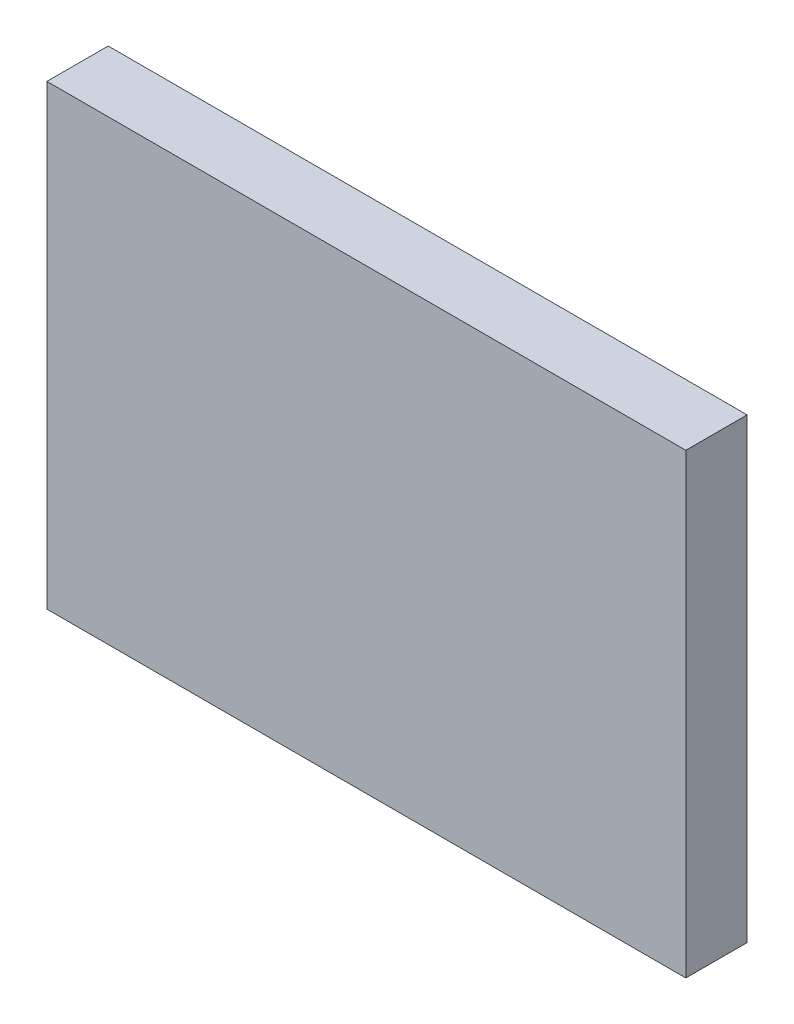
ISO-10303-21;
HEADER;
FILE_DESCRIPTION(('STEP AP214'),'2;1');
FILE_NAME('part.step','',(''),(''),'','','');
FILE_SCHEMA(('AUTOMOTIVE_DESIGN { 1 0 10303 214 1 1 1 1 }'));
ENDSEC;
DATA;
#1=APPLICATION_CONTEXT('core data for automotive mechanical design processes');
#2=APPLICATION_PROTOCOL_DEFINITION('international standard','automotive_design',2000,#1);
#3=PRODUCT_CONTEXT('',#1,'mechanical');
#4=PRODUCT('Part','Part','',(#3));
#5=PRODUCT_RELATED_PRODUCT_CATEGORY('part','',(#4));
#6=PRODUCT_DEFINITION_FORMATION('','',#4);
#7=PRODUCT_DEFINITION_CONTEXT('part definition',#1,'design');
#8=PRODUCT_DEFINITION('design','',#6,#7);
#9=PRODUCT_DEFINITION_SHAPE('','',#8);
#10=(LENGTH_UNIT() NAMED_UNIT(*) SI_UNIT(.MILLI.,.METRE.));
#11=(NAMED_UNIT(*) PLANE_ANGLE_UNIT() SI_UNIT($,.RADIAN.));
#12=(NAMED_UNIT(*) SI_UNIT($,.STERADIAN.) SOLID_ANGLE_UNIT());
#13=UNCERTAINTY_MEASURE_WITH_UNIT(LENGTH_MEASURE(1.E-05),#10,'distance_accuracy_value','');
#14=(GEOMETRIC_REPRESENTATION_CONTEXT(3) GLOBAL_UNCERTAINTY_ASSIGNED_CONTEXT((#13)) GLOBAL_UNIT_ASSIGNED_CONTEXT((#10,
#11,#12)) REPRESENTATION_CONTEXT('',''));
#15=CARTESIAN_POINT('',(0.,0.,0.));
#16=DIRECTION('',(0.,0.,1.));
#17=DIRECTION('',(1.,0.,0.));
#18=AXIS2_PLACEMENT_3D('',#15,#16,#17);
#19=CARTESIAN_POINT('',(1.2400408919979,-0.626373786984169,0.));
#20=DIRECTION('',(1.,0.,0.));
#21=DIRECTION('',(0.,1.,0.));
#22=AXIS2_PLACEMENT_3D('',#19,#20,#21);
#23=PLANE('',#22);
#24=DIRECTION('',(0.,1.,0.));
#25=VECTOR('',#24,1.);
#26=CARTESIAN_POINT('',(1.2400408919979,-0.626373786984169,0.));
#27=LINE('',#26,#25);
#28=CARTESIAN_POINT('',(1.2400408919979,-0.626373786984169,0.));
#29=VERTEX_POINT('',#28);
#30=CARTESIAN_POINT('',(1.2400408919979,-0.604008281971269,0.));
#31=VERTEX_POINT('',#30);
#32=EDGE_CURVE('E11',#29,#31,#27,.T.);
#33=ORIENTED_EDGE('',*,*,#32,.T.);
#34=DIRECTION('',(0.,0.,1.));
#35=VECTOR('',#34,1.);
#36=CARTESIAN_POINT('',(1.2400408919979,-0.604008281971269,0.));
#37=LINE('',#36,#35);
#38=CARTESIAN_POINT('',(1.2400408919979,-0.604008281971269,0.003));
#39=VERTEX_POINT('',#38);
#40=EDGE_CURVE('E24',#31,#39,#37,.T.);
#41=ORIENTED_EDGE('',*,*,#40,.T.);
#42=DIRECTION('',(0.,1.,0.));
#43=VECTOR('',#42,1.);
#44=CARTESIAN_POINT('',(1.2400408919979,-0.626373786984169,0.003));
#45=LINE('',#44,#43);
#46=CARTESIAN_POINT('',(1.2400408919979,-0.626373786984169,0.003));
#47=VERTEX_POINT('',#46);
#48=EDGE_CURVE('E75',#47,#39,#45,.T.);
#49=ORIENTED_EDGE('',*,*,#48,.F.);
#50=DIRECTION('',(0.,0.,1.));
#51=VECTOR('',#50,1.);
#52=CARTESIAN_POINT('',(1.2400408919979,-0.626373786984169,0.));
#53=LINE('',#52,#51);
#54=EDGE_CURVE('E86',#29,#47,#53,.T.);
#55=ORIENTED_EDGE('',*,*,#54,.F.);
#56=EDGE_LOOP('',(#33,#41,#49,#55));
#57=FACE_BOUND('',#56,.T.);
#58=ADVANCED_FACE('F17',(#57),#23,.T.);
#59=CARTESIAN_POINT('',(1.2087748288676,-0.626373786984169,0.));
#60=DIRECTION('',(0.,-1.,0.));
#61=DIRECTION('',(1.,0.,0.));
#62=AXIS2_PLACEMENT_3D('',#59,#60,#61);
#63=PLANE('',#62);
#64=DIRECTION('',(1.,0.,0.));
#65=VECTOR('',#64,1.);
#66=CARTESIAN_POINT('',(1.2087748288676,-0.626373786984169,0.));
#67=LINE('',#66,#65);
#68=CARTESIAN_POINT('',(1.2087748288676,-0.626373786984169,0.));
#69=VERTEX_POINT('',#68);
#70=EDGE_CURVE('E83',#69,#29,#67,.T.);
#71=ORIENTED_EDGE('',*,*,#70,.T.);
#72=ORIENTED_EDGE('',*,*,#54,.T.);
#73=DIRECTION('',(1.,0.,0.));
#74=VECTOR('',#73,1.);
#75=CARTESIAN_POINT('',(1.2087748288676,-0.626373786984169,0.003));
#76=LINE('',#75,#74);
#77=CARTESIAN_POINT('',(1.2087748288676,-0.626373786984169,0.003));
#78=VERTEX_POINT('',#77);
#79=EDGE_CURVE('E81',#78,#47,#76,.T.);
#80=ORIENTED_EDGE('',*,*,#79,.F.);
#81=DIRECTION('',(0.,0.,1.));
#82=VECTOR('',#81,1.);
#83=CARTESIAN_POINT('',(1.2087748288676,-0.626373786984169,0.));
#84=LINE('',#83,#82);
#85=EDGE_CURVE('E61',#69,#78,#84,.T.);
#86=ORIENTED_EDGE('',*,*,#85,.F.);
#87=EDGE_LOOP('',(#71,#72,#80,#86));
#88=FACE_BOUND('',#87,.T.);
#89=ADVANCED_FACE('F91',(#88),#63,.T.);
#90=CARTESIAN_POINT('',(1.2087748288676,-0.604008281971269,0.));
#91=DIRECTION('',(-1.,0.,0.));
#92=DIRECTION('',(0.,-1.,0.));
#93=AXIS2_PLACEMENT_3D('',#90,#91,#92);
#94=PLANE('',#93);
#95=DIRECTION('',(0.,-1.,0.));
#96=VECTOR('',#95,1.);
#97=CARTESIAN_POINT('',(1.2087748288676,-0.604008281971269,0.));
#98=LINE('',#97,#96);
#99=CARTESIAN_POINT('',(1.2087748288676,-0.604008281971269,0.));
#100=VERTEX_POINT('',#99);
#101=EDGE_CURVE('E65',#100,#69,#98,.T.);
#102=ORIENTED_EDGE('',*,*,#101,.T.);
#103=ORIENTED_EDGE('',*,*,#85,.T.);
#104=DIRECTION('',(0.,-1.,0.));
#105=VECTOR('',#104,1.);
#106=CARTESIAN_POINT('',(1.2087748288676,-0.604008281971269,0.003));
#107=LINE('',#106,#105);
#108=CARTESIAN_POINT('',(1.2087748288676,-0.604008281971269,0.003));
#109=VERTEX_POINT('',#108);
#110=EDGE_CURVE('E54',#109,#78,#107,.T.);
#111=ORIENTED_EDGE('',*,*,#110,.F.);
#112=DIRECTION('',(0.,0.,1.));
#113=VECTOR('',#112,1.);
#114=CARTESIAN_POINT('',(1.2087748288676,-0.604008281971269,0.));
#115=LINE('',#114,#113);
#116=EDGE_CURVE('E58',#100,#109,#115,.T.);
#117=ORIENTED_EDGE('',*,*,#116,.F.);
#118=EDGE_LOOP('',(#102,#103,#111,#117));
#119=FACE_BOUND('',#118,.T.);
#120=ADVANCED_FACE('F57',(#119),#94,.T.);
#121=CARTESIAN_POINT('',(1.2400408919979,-0.604008281971269,0.));
#122=DIRECTION('',(0.,1.,0.));
#123=DIRECTION('',(-1.,0.,0.));
#124=AXIS2_PLACEMENT_3D('',#121,#122,#123);
#125=PLANE('',#124);
#126=DIRECTION('',(-1.,0.,0.));
#127=VECTOR('',#126,1.);
#128=CARTESIAN_POINT('',(1.2400408919979,-0.604008281971269,0.));
#129=LINE('',#128,#127);
#130=EDGE_CURVE('E71',#31,#100,#129,.T.);
#131=ORIENTED_EDGE('',*,*,#130,.T.);
#132=ORIENTED_EDGE('',*,*,#116,.T.);
#133=DIRECTION('',(-1.,0.,0.));
#134=VECTOR('',#133,1.);
#135=CARTESIAN_POINT('',(1.2400408919979,-0.604008281971269,0.003));
#136=LINE('',#135,#134);
#137=EDGE_CURVE('E70',#39,#109,#136,.T.);
#138=ORIENTED_EDGE('',*,*,#137,.F.);
#139=ORIENTED_EDGE('',*,*,#40,.F.);
#140=EDGE_LOOP('',(#131,#132,#138,#139));
#141=FACE_BOUND('',#140,.T.);
#142=ADVANCED_FACE('F69',(#141),#125,.T.);
#143=CARTESIAN_POINT('',(1.2244078604327,-0.615191034477719,0.003));
#144=DIRECTION('',(0.,0.,1.));
#145=DIRECTION('',(1.,0.,0.));
#146=AXIS2_PLACEMENT_3D('',#143,#144,#145);
#147=PLANE('',#146);
#148=ORIENTED_EDGE('',*,*,#137,.T.);
#149=ORIENTED_EDGE('',*,*,#110,.T.);
#150=ORIENTED_EDGE('',*,*,#79,.T.);
#151=ORIENTED_EDGE('',*,*,#48,.T.);
#152=EDGE_LOOP('',(#148,#149,#150,#151));
#153=FACE_BOUND('',#152,.T.);
#154=ADVANCED_FACE('F74',(#153),#147,.T.);
#155=CARTESIAN_POINT('',(1.2244078604327,-0.615191034477719,0.));
#156=DIRECTION('',(0.,0.,1.));
#157=DIRECTION('',(1.,0.,0.));
#158=AXIS2_PLACEMENT_3D('',#155,#156,#157);
#159=PLANE('',#158);
#160=ORIENTED_EDGE('',*,*,#130,.F.);
#161=ORIENTED_EDGE('',*,*,#32,.F.);
#162=ORIENTED_EDGE('',*,*,#70,.F.);
#163=ORIENTED_EDGE('',*,*,#101,.F.);
#164=EDGE_LOOP('',(#160,#161,#162,#163));
#165=FACE_BOUND('',#164,.T.);
#166=ADVANCED_FACE('F89',(#165),#159,.F.);
#167=CLOSED_SHELL('',(#58,#89,#120,#142,#154,#166));
#168=MANIFOLD_SOLID_BREP('B1',#167);
#169=ADVANCED_BREP_SHAPE_REPRESENTATION('',(#18,#168),#14);
#170=SHAPE_DEFINITION_REPRESENTATION(#9,#169);
ENDSEC;
END-ISO-10303-21;
